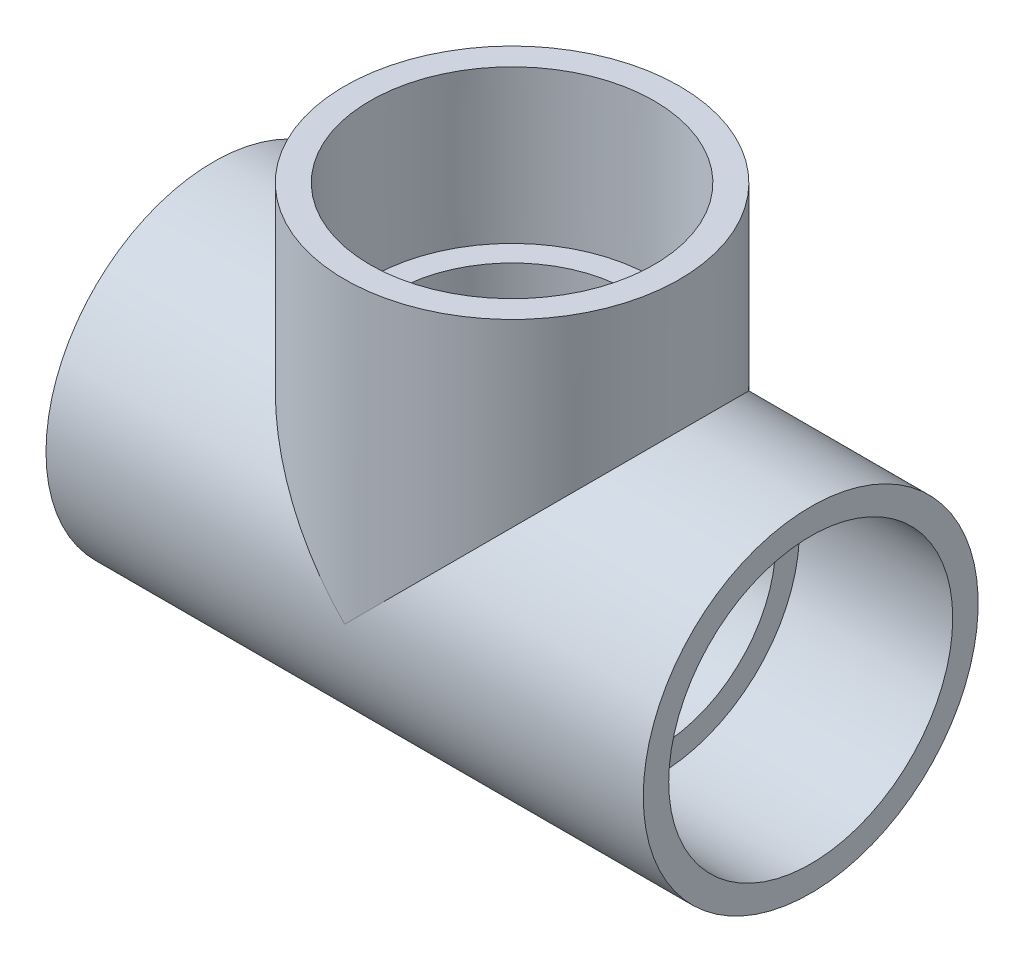
ISO-10303-21;
HEADER;
FILE_DESCRIPTION(('STEP AP214'),'2;1');
FILE_NAME('part.step','',(''),(''),'','','');
FILE_SCHEMA(('AUTOMOTIVE_DESIGN { 1 0 10303 214 1 1 1 1 }'));
ENDSEC;
DATA;
#1=APPLICATION_CONTEXT('core data for automotive mechanical design processes');
#2=APPLICATION_PROTOCOL_DEFINITION('international standard','automotive_design',2000,#1);
#3=PRODUCT_CONTEXT('',#1,'mechanical');
#4=PRODUCT('Part','Part','',(#3));
#5=PRODUCT_RELATED_PRODUCT_CATEGORY('part','',(#4));
#6=PRODUCT_DEFINITION_FORMATION('','',#4);
#7=PRODUCT_DEFINITION_CONTEXT('part definition',#1,'design');
#8=PRODUCT_DEFINITION('design','',#6,#7);
#9=PRODUCT_DEFINITION_SHAPE('','',#8);
#10=(LENGTH_UNIT() NAMED_UNIT(*) SI_UNIT(.MILLI.,.METRE.));
#11=(NAMED_UNIT(*) PLANE_ANGLE_UNIT() SI_UNIT($,.RADIAN.));
#12=(NAMED_UNIT(*) SI_UNIT($,.STERADIAN.) SOLID_ANGLE_UNIT());
#13=UNCERTAINTY_MEASURE_WITH_UNIT(LENGTH_MEASURE(1.E-05),#10,'distance_accuracy_value','');
#14=(GEOMETRIC_REPRESENTATION_CONTEXT(3) GLOBAL_UNCERTAINTY_ASSIGNED_CONTEXT((#13)) GLOBAL_UNIT_ASSIGNED_CONTEXT((#10,
#11,#12)) REPRESENTATION_CONTEXT('',''));
#15=CARTESIAN_POINT('',(0.,0.,0.));
#16=DIRECTION('',(0.,0.,1.));
#17=DIRECTION('',(1.,0.,0.));
#18=AXIS2_PLACEMENT_3D('',#15,#16,#17);
#19=CARTESIAN_POINT('',(-93.9038,0.,0.));
#20=DIRECTION('',(-1.,0.,0.));
#21=DIRECTION('',(0.,0.,1.));
#22=AXIS2_PLACEMENT_3D('',#19,#20,#21);
#23=CYLINDRICAL_SURFACE('',#22,52.6542);
#24=CARTESIAN_POINT('',(-93.9038,0.,0.));
#25=DIRECTION('',(-1.,0.,0.));
#26=DIRECTION('',(0.,0.,1.));
#27=AXIS2_PLACEMENT_3D('',#24,#25,#26);
#28=CIRCLE('',#27,52.6542);
#29=CARTESIAN_POINT('',(-93.9038,0.,52.6542));
#30=VERTEX_POINT('',#29);
#31=EDGE_CURVE('E118',#30,#30,#28,.T.);
#32=ORIENTED_EDGE('',*,*,#31,.F.);
#33=EDGE_LOOP('',(#32));
#34=FACE_BOUND('',#33,.T.);
#35=CARTESIAN_POINT('',(93.9038,0.,0.));
#36=DIRECTION('',(-1.,0.,0.));
#37=DIRECTION('',(0.,0.,1.));
#38=AXIS2_PLACEMENT_3D('',#35,#36,#37);
#39=CIRCLE('',#38,52.6542);
#40=CARTESIAN_POINT('',(93.9038,0.,52.6542));
#41=VERTEX_POINT('',#40);
#42=EDGE_CURVE('E91',#41,#41,#39,.T.);
#43=ORIENTED_EDGE('',*,*,#42,.T.);
#44=EDGE_LOOP('',(#43));
#45=FACE_BOUND('',#44,.T.);
#46=CARTESIAN_POINT('',(0.,0.,0.));
#47=DIRECTION('',(-0.707106781186547,-0.707106781186547,0.));
#48=DIRECTION('',(-0.707106781186547,0.707106781186547,0.));
#49=AXIS2_PLACEMENT_3D('',#46,#47,#48);
#50=ELLIPSE('',#49,74.4642837559054,52.6542);
#51=CARTESIAN_POINT('',(0.,0.,-52.6542));
#52=VERTEX_POINT('',#51);
#53=CARTESIAN_POINT('',(0.,0.,52.6542));
#54=VERTEX_POINT('',#53);
#55=EDGE_CURVE('E65',#52,#54,#50,.F.);
#56=ORIENTED_EDGE('',*,*,#55,.F.);
#57=CARTESIAN_POINT('',(0.,0.,0.));
#58=DIRECTION('',(0.707106781186547,-0.707106781186547,0.));
#59=DIRECTION('',(-0.707106781186547,-0.707106781186547,0.));
#60=AXIS2_PLACEMENT_3D('',#57,#58,#59);
#61=ELLIPSE('',#60,74.4642837559054,52.6542);
#62=EDGE_CURVE('E106',#52,#54,#61,.T.);
#63=ORIENTED_EDGE('',*,*,#62,.T.);
#64=EDGE_LOOP('',(#56,#63));
#65=FACE_BOUND('',#64,.T.);
#66=ADVANCED_FACE('F43',(#34,#45,#65),#23,.T.);
#67=CARTESIAN_POINT('',(-93.9038,-52.6542,0.));
#68=DIRECTION('',(-1.,0.,0.));
#69=DIRECTION('',(0.,0.,1.));
#70=AXIS2_PLACEMENT_3D('',#67,#68,#69);
#71=PLANE('',#70);
#72=ORIENTED_EDGE('',*,*,#31,.T.);
#73=EDGE_LOOP('',(#72));
#74=FACE_BOUND('',#73,.T.);
#75=CARTESIAN_POINT('',(-93.9038,0.,0.));
#76=DIRECTION('',(-1.,0.,0.));
#77=DIRECTION('',(0.,0.,1.));
#78=AXIS2_PLACEMENT_3D('',#75,#76,#77);
#79=CIRCLE('',#78,44.6532);
#80=CARTESIAN_POINT('',(-93.9038,0.,44.6532));
#81=VERTEX_POINT('',#80);
#82=EDGE_CURVE('E127',#81,#81,#79,.T.);
#83=ORIENTED_EDGE('',*,*,#82,.F.);
#84=EDGE_LOOP('',(#83));
#85=FACE_BOUND('',#84,.T.);
#86=ADVANCED_FACE('F45',(#74,#85),#71,.T.);
#87=CARTESIAN_POINT('',(-46.0248,0.,0.));
#88=DIRECTION('',(-1.,0.,0.));
#89=DIRECTION('',(0.,0.,1.));
#90=AXIS2_PLACEMENT_3D('',#87,#88,#89);
#91=CONICAL_SURFACE('',#90,44.3484,0.0063659617494356);
#92=ORIENTED_EDGE('',*,*,#82,.T.);
#93=EDGE_LOOP('',(#92));
#94=FACE_BOUND('',#93,.T.);
#95=CARTESIAN_POINT('',(-46.0248,0.,0.));
#96=DIRECTION('',(-1.,0.,0.));
#97=DIRECTION('',(0.,0.,1.));
#98=AXIS2_PLACEMENT_3D('',#95,#96,#97);
#99=CIRCLE('',#98,44.3484);
#100=CARTESIAN_POINT('',(-46.0248,0.,44.3484));
#101=VERTEX_POINT('',#100);
#102=EDGE_CURVE('E123',#101,#101,#99,.T.);
#103=ORIENTED_EDGE('',*,*,#102,.F.);
#104=EDGE_LOOP('',(#103));
#105=FACE_BOUND('',#104,.T.);
#106=ADVANCED_FACE('F162',(#94,#105),#91,.F.);
#107=CARTESIAN_POINT('',(190.341826547667,46.0248,-25.5769928373138));
#108=DIRECTION('',(0.,-1.,0.));
#109=DIRECTION('',(0.,0.,-1.));
#110=AXIS2_PLACEMENT_3D('',#107,#108,#109);
#111=PLANE('',#110);
#112=CARTESIAN_POINT('',(0.,46.0248,0.));
#113=DIRECTION('',(0.,1.,0.));
#114=DIRECTION('',(0.,0.,1.));
#115=AXIS2_PLACEMENT_3D('',#112,#113,#114);
#116=CIRCLE('',#115,36.83);
#117=CARTESIAN_POINT('',(0.,46.0248,36.83));
#118=VERTEX_POINT('',#117);
#119=EDGE_CURVE('E88',#118,#118,#116,.T.);
#120=ORIENTED_EDGE('',*,*,#119,.F.);
#121=EDGE_LOOP('',(#120));
#122=FACE_BOUND('',#121,.T.);
#123=CARTESIAN_POINT('',(0.,46.0248,0.));
#124=DIRECTION('',(0.,-1.,0.));
#125=DIRECTION('',(0.,0.,-1.));
#126=AXIS2_PLACEMENT_3D('',#123,#124,#125);
#127=CIRCLE('',#126,44.3484);
#128=CARTESIAN_POINT('',(0.,46.0248,-44.3484));
#129=VERTEX_POINT('',#128);
#130=EDGE_CURVE('E73',#129,#129,#127,.F.);
#131=ORIENTED_EDGE('',*,*,#130,.T.);
#132=EDGE_LOOP('',(#131));
#133=FACE_BOUND('',#132,.T.);
#134=ADVANCED_FACE('F134',(#122,#133),#111,.F.);
#135=CARTESIAN_POINT('',(-46.0248,0.,0.));
#136=DIRECTION('',(1.,0.,0.));
#137=DIRECTION('',(0.,0.,-1.));
#138=AXIS2_PLACEMENT_3D('',#135,#136,#137);
#139=PLANE('',#138);
#140=CARTESIAN_POINT('',(-46.0248,0.,0.));
#141=DIRECTION('',(-1.,0.,0.));
#142=DIRECTION('',(0.,0.,1.));
#143=AXIS2_PLACEMENT_3D('',#140,#141,#142);
#144=CIRCLE('',#143,36.83);
#145=CARTESIAN_POINT('',(-46.0248,0.,36.83));
#146=VERTEX_POINT('',#145);
#147=EDGE_CURVE('E85',#146,#146,#144,.T.);
#148=ORIENTED_EDGE('',*,*,#147,.F.);
#149=EDGE_LOOP('',(#148));
#150=FACE_BOUND('',#149,.T.);
#151=ORIENTED_EDGE('',*,*,#102,.T.);
#152=EDGE_LOOP('',(#151));
#153=FACE_BOUND('',#152,.T.);
#154=ADVANCED_FACE('F147',(#150,#153),#139,.F.);
#155=CARTESIAN_POINT('',(52.6542,93.9038,0.));
#156=DIRECTION('',(0.,1.,0.));
#157=DIRECTION('',(0.,0.,1.));
#158=AXIS2_PLACEMENT_3D('',#155,#156,#157);
#159=PLANE('',#158);
#160=CARTESIAN_POINT('',(0.,93.9038,0.));
#161=DIRECTION('',(0.,-1.,0.));
#162=DIRECTION('',(0.,0.,-1.));
#163=AXIS2_PLACEMENT_3D('',#160,#161,#162);
#164=CIRCLE('',#163,44.6532);
#165=CARTESIAN_POINT('',(0.,93.9038,-44.6532));
#166=VERTEX_POINT('',#165);
#167=EDGE_CURVE('E109',#166,#166,#164,.T.);
#168=ORIENTED_EDGE('',*,*,#167,.T.);
#169=EDGE_LOOP('',(#168));
#170=FACE_BOUND('',#169,.T.);
#171=CARTESIAN_POINT('',(0.,93.9038,0.));
#172=DIRECTION('',(0.,-1.,0.));
#173=DIRECTION('',(0.,0.,-1.));
#174=AXIS2_PLACEMENT_3D('',#171,#172,#173);
#175=CIRCLE('',#174,52.6542);
#176=CARTESIAN_POINT('',(0.,93.9038,-52.6542));
#177=VERTEX_POINT('',#176);
#178=EDGE_CURVE('E112',#177,#177,#175,.T.);
#179=ORIENTED_EDGE('',*,*,#178,.F.);
#180=EDGE_LOOP('',(#179));
#181=FACE_BOUND('',#180,.T.);
#182=ADVANCED_FACE('F144',(#170,#181),#159,.T.);
#183=CARTESIAN_POINT('',(0.,0.,0.));
#184=DIRECTION('',(0.,-1.,0.));
#185=DIRECTION('',(0.,0.,-1.));
#186=AXIS2_PLACEMENT_3D('',#183,#184,#185);
#187=CYLINDRICAL_SURFACE('',#186,52.6542);
#188=ORIENTED_EDGE('',*,*,#62,.F.);
#189=ORIENTED_EDGE('',*,*,#55,.T.);
#190=EDGE_LOOP('',(#188,#189));
#191=FACE_BOUND('',#190,.T.);
#192=ORIENTED_EDGE('',*,*,#178,.T.);
#193=EDGE_LOOP('',(#192));
#194=FACE_BOUND('',#193,.T.);
#195=ADVANCED_FACE('F140',(#191,#194),#187,.T.);
#196=CARTESIAN_POINT('',(0.,93.9038,0.));
#197=DIRECTION('',(0.,1.,0.));
#198=DIRECTION('',(0.,0.,1.));
#199=AXIS2_PLACEMENT_3D('',#196,#197,#198);
#200=CONICAL_SURFACE('',#199,44.6532,0.0063659617494356);
#201=ORIENTED_EDGE('',*,*,#130,.F.);
#202=EDGE_LOOP('',(#201));
#203=FACE_BOUND('',#202,.T.);
#204=ORIENTED_EDGE('',*,*,#167,.F.);
#205=EDGE_LOOP('',(#204));
#206=FACE_BOUND('',#205,.T.);
#207=ADVANCED_FACE('F136',(#203,#206),#200,.F.);
#208=CARTESIAN_POINT('',(93.9038,-52.6542,0.));
#209=DIRECTION('',(1.,0.,0.));
#210=DIRECTION('',(0.,0.,1.));
#211=AXIS2_PLACEMENT_3D('',#208,#209,#210);
#212=PLANE('',#211);
#213=ORIENTED_EDGE('',*,*,#42,.F.);
#214=EDGE_LOOP('',(#213));
#215=FACE_BOUND('',#214,.T.);
#216=CARTESIAN_POINT('',(93.9038,0.,0.));
#217=DIRECTION('',(-1.,0.,0.));
#218=DIRECTION('',(0.,0.,1.));
#219=AXIS2_PLACEMENT_3D('',#216,#217,#218);
#220=CIRCLE('',#219,44.6532);
#221=CARTESIAN_POINT('',(93.9038,0.,44.6532));
#222=VERTEX_POINT('',#221);
#223=EDGE_CURVE('E103',#222,#222,#220,.T.);
#224=ORIENTED_EDGE('',*,*,#223,.T.);
#225=EDGE_LOOP('',(#224));
#226=FACE_BOUND('',#225,.T.);
#227=ADVANCED_FACE('F139',(#215,#226),#212,.T.);
#228=CARTESIAN_POINT('',(46.0248,0.,0.));
#229=DIRECTION('',(1.,0.,0.));
#230=DIRECTION('',(0.,0.,1.));
#231=AXIS2_PLACEMENT_3D('',#228,#229,#230);
#232=CONICAL_SURFACE('',#231,44.3484,0.0063659617494356);
#233=ORIENTED_EDGE('',*,*,#223,.F.);
#234=EDGE_LOOP('',(#233));
#235=FACE_BOUND('',#234,.T.);
#236=CARTESIAN_POINT('',(46.0248,0.,0.));
#237=DIRECTION('',(-1.,0.,0.));
#238=DIRECTION('',(0.,0.,1.));
#239=AXIS2_PLACEMENT_3D('',#236,#237,#238);
#240=CIRCLE('',#239,44.3484);
#241=CARTESIAN_POINT('',(46.0248,0.,44.3484));
#242=VERTEX_POINT('',#241);
#243=EDGE_CURVE('E99',#242,#242,#240,.T.);
#244=ORIENTED_EDGE('',*,*,#243,.T.);
#245=EDGE_LOOP('',(#244));
#246=FACE_BOUND('',#245,.T.);
#247=ADVANCED_FACE('F183',(#235,#246),#232,.F.);
#248=CARTESIAN_POINT('',(46.0248,-52.6542,0.));
#249=DIRECTION('',(-1.,0.,0.));
#250=DIRECTION('',(0.,0.,-1.));
#251=AXIS2_PLACEMENT_3D('',#248,#249,#250);
#252=PLANE('',#251);
#253=CARTESIAN_POINT('',(46.0248,0.,0.));
#254=DIRECTION('',(-1.,0.,0.));
#255=DIRECTION('',(0.,0.,1.));
#256=AXIS2_PLACEMENT_3D('',#253,#254,#255);
#257=CIRCLE('',#256,36.83);
#258=CARTESIAN_POINT('',(46.0248,0.,36.83));
#259=VERTEX_POINT('',#258);
#260=EDGE_CURVE('E82',#259,#259,#257,.F.);
#261=ORIENTED_EDGE('',*,*,#260,.F.);
#262=EDGE_LOOP('',(#261));
#263=FACE_BOUND('',#262,.T.);
#264=ORIENTED_EDGE('',*,*,#243,.F.);
#265=EDGE_LOOP('',(#264));
#266=FACE_BOUND('',#265,.T.);
#267=ADVANCED_FACE('F77',(#263,#266),#252,.F.);
#268=CARTESIAN_POINT('',(150.195771004402,0.,0.));
#269=DIRECTION('',(-1.,0.,0.));
#270=DIRECTION('',(0.,0.,1.));
#271=AXIS2_PLACEMENT_3D('',#268,#269,#270);
#272=CYLINDRICAL_SURFACE('',#271,36.83);
#273=CARTESIAN_POINT('',(0.,0.,0.));
#274=DIRECTION('',(-0.707106781186547,-0.707106781186547,0.));
#275=DIRECTION('',(-0.707106781186547,0.707106781186547,0.));
#276=AXIS2_PLACEMENT_3D('',#273,#274,#275);
#277=ELLIPSE('',#276,52.0854855022011,36.83);
#278=CARTESIAN_POINT('',(0.,0.,-36.83));
#279=VERTEX_POINT('',#278);
#280=CARTESIAN_POINT('',(0.,0.,36.83));
#281=VERTEX_POINT('',#280);
#282=EDGE_CURVE('E52',#279,#281,#277,.F.);
#283=ORIENTED_EDGE('',*,*,#282,.T.);
#284=CARTESIAN_POINT('',(0.,0.,0.));
#285=DIRECTION('',(-0.707106781186547,0.707106781186547,0.));
#286=DIRECTION('',(-0.707106781186547,-0.707106781186547,0.));
#287=AXIS2_PLACEMENT_3D('',#284,#285,#286);
#288=ELLIPSE('',#287,52.0854855022011,36.83);
#289=EDGE_CURVE('E11',#281,#279,#288,.T.);
#290=ORIENTED_EDGE('',*,*,#289,.T.);
#291=EDGE_LOOP('',(#283,#290));
#292=FACE_BOUND('',#291,.T.);
#293=ORIENTED_EDGE('',*,*,#260,.T.);
#294=EDGE_LOOP('',(#293));
#295=FACE_BOUND('',#294,.T.);
#296=ORIENTED_EDGE('',*,*,#147,.T.);
#297=EDGE_LOOP('',(#296));
#298=FACE_BOUND('',#297,.T.);
#299=ADVANCED_FACE('F74',(#292,#295,#298),#272,.F.);
#300=CARTESIAN_POINT('',(0.,0.,0.));
#301=DIRECTION('',(0.,1.,0.));
#302=DIRECTION('',(0.,0.,1.));
#303=AXIS2_PLACEMENT_3D('',#300,#301,#302);
#304=CYLINDRICAL_SURFACE('',#303,36.83);
#305=ORIENTED_EDGE('',*,*,#119,.T.);
#306=EDGE_LOOP('',(#305));
#307=FACE_BOUND('',#306,.T.);
#308=ORIENTED_EDGE('',*,*,#282,.F.);
#309=ORIENTED_EDGE('',*,*,#289,.F.);
#310=EDGE_LOOP('',(#308,#309));
#311=FACE_BOUND('',#310,.T.);
#312=ADVANCED_FACE('F70',(#307,#311),#304,.F.);
#313=CLOSED_SHELL('',(#66,#86,#106,#134,#154,#182,#195,#207,#227,#247,#267,#299,#312));
#314=MANIFOLD_SOLID_BREP('B2',#313);
#315=ADVANCED_BREP_SHAPE_REPRESENTATION('',(#18,#314),#14);
#316=SHAPE_DEFINITION_REPRESENTATION(#9,#315);
ENDSEC;
END-ISO-10303-21;
